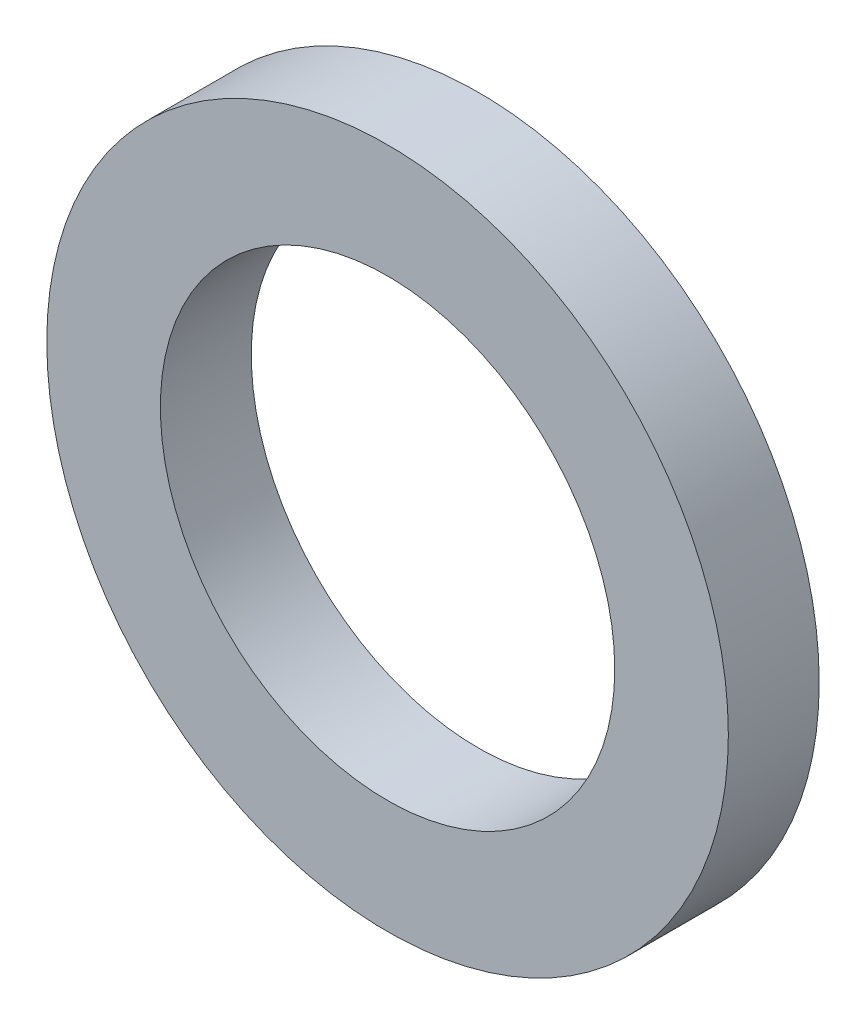
ISO-10303-21;
HEADER;
FILE_DESCRIPTION(('STEP AP214'),'2;1');
FILE_NAME('part.step','',(''),(''),'','','');
FILE_SCHEMA(('AUTOMOTIVE_DESIGN { 1 0 10303 214 1 1 1 1 }'));
ENDSEC;
DATA;
#1=APPLICATION_CONTEXT('core data for automotive mechanical design processes');
#2=APPLICATION_PROTOCOL_DEFINITION('international standard','automotive_design',2000,#1);
#3=PRODUCT_CONTEXT('',#1,'mechanical');
#4=PRODUCT('Part','Part','',(#3));
#5=PRODUCT_RELATED_PRODUCT_CATEGORY('part','',(#4));
#6=PRODUCT_DEFINITION_FORMATION('','',#4);
#7=PRODUCT_DEFINITION_CONTEXT('part definition',#1,'design');
#8=PRODUCT_DEFINITION('design','',#6,#7);
#9=PRODUCT_DEFINITION_SHAPE('','',#8);
#10=(LENGTH_UNIT() NAMED_UNIT(*) SI_UNIT(.MILLI.,.METRE.));
#11=(NAMED_UNIT(*) PLANE_ANGLE_UNIT() SI_UNIT($,.RADIAN.));
#12=(NAMED_UNIT(*) SI_UNIT($,.STERADIAN.) SOLID_ANGLE_UNIT());
#13=UNCERTAINTY_MEASURE_WITH_UNIT(LENGTH_MEASURE(1.E-05),#10,'distance_accuracy_value','');
#14=(GEOMETRIC_REPRESENTATION_CONTEXT(3) GLOBAL_UNCERTAINTY_ASSIGNED_CONTEXT((#13)) GLOBAL_UNIT_ASSIGNED_CONTEXT((#10,
#11,#12)) REPRESENTATION_CONTEXT('',''));
#15=CARTESIAN_POINT('',(0.,0.,0.));
#16=DIRECTION('',(0.,0.,1.));
#17=DIRECTION('',(1.,0.,0.));
#18=AXIS2_PLACEMENT_3D('',#15,#16,#17);
#19=CARTESIAN_POINT('',(0.,0.,0.8));
#20=DIRECTION('',(0.,0.,1.));
#21=DIRECTION('',(1.,0.,0.));
#22=AXIS2_PLACEMENT_3D('',#19,#20,#21);
#23=PLANE('',#22);
#24=CARTESIAN_POINT('',(0.,0.,0.8));
#25=DIRECTION('',(0.,0.,1.));
#26=DIRECTION('',(1.,0.,0.));
#27=AXIS2_PLACEMENT_3D('',#24,#25,#26);
#28=CIRCLE('',#27,3.);
#29=CARTESIAN_POINT('',(3.,0.,0.8));
#30=VERTEX_POINT('',#29);
#31=EDGE_CURVE('E10',#30,#30,#28,.T.);
#32=ORIENTED_EDGE('',*,*,#31,.T.);
#33=EDGE_LOOP('',(#32));
#34=FACE_BOUND('',#33,.T.);
#35=CARTESIAN_POINT('',(0.,0.,0.8));
#36=DIRECTION('',(0.,0.,1.));
#37=DIRECTION('',(1.,0.,0.));
#38=AXIS2_PLACEMENT_3D('',#35,#36,#37);
#39=CIRCLE('',#38,2.);
#40=CARTESIAN_POINT('',(2.,0.,0.8));
#41=VERTEX_POINT('',#40);
#42=EDGE_CURVE('E54',#41,#41,#39,.T.);
#43=ORIENTED_EDGE('',*,*,#42,.F.);
#44=EDGE_LOOP('',(#43));
#45=FACE_BOUND('',#44,.T.);
#46=ADVANCED_FACE('F41',(#34,#45),#23,.T.);
#47=CARTESIAN_POINT('',(0.,0.,0.));
#48=DIRECTION('',(0.,0.,1.));
#49=DIRECTION('',(1.,0.,0.));
#50=AXIS2_PLACEMENT_3D('',#47,#48,#49);
#51=PLANE('',#50);
#52=CARTESIAN_POINT('',(0.,0.,0.));
#53=DIRECTION('',(0.,0.,1.));
#54=DIRECTION('',(1.,0.,0.));
#55=AXIS2_PLACEMENT_3D('',#52,#53,#54);
#56=CIRCLE('',#55,3.);
#57=CARTESIAN_POINT('',(3.,0.,0.));
#58=VERTEX_POINT('',#57);
#59=EDGE_CURVE('E45',#58,#58,#56,.T.);
#60=ORIENTED_EDGE('',*,*,#59,.F.);
#61=EDGE_LOOP('',(#60));
#62=FACE_BOUND('',#61,.T.);
#63=CARTESIAN_POINT('',(0.,0.,0.));
#64=DIRECTION('',(0.,0.,1.));
#65=DIRECTION('',(1.,0.,0.));
#66=AXIS2_PLACEMENT_3D('',#63,#64,#65);
#67=CIRCLE('',#66,2.);
#68=CARTESIAN_POINT('',(2.,0.,0.));
#69=VERTEX_POINT('',#68);
#70=EDGE_CURVE('E56',#69,#69,#67,.T.);
#71=ORIENTED_EDGE('',*,*,#70,.T.);
#72=EDGE_LOOP('',(#71));
#73=FACE_BOUND('',#72,.T.);
#74=ADVANCED_FACE('F68',(#62,#73),#51,.F.);
#75=CARTESIAN_POINT('',(0.,0.,0.8));
#76=DIRECTION('',(0.,0.,-1.));
#77=DIRECTION('',(-1.,0.,0.));
#78=AXIS2_PLACEMENT_3D('',#75,#76,#77);
#79=CYLINDRICAL_SURFACE('',#78,3.);
#80=ORIENTED_EDGE('',*,*,#31,.F.);
#81=EDGE_LOOP('',(#80));
#82=FACE_BOUND('',#81,.T.);
#83=ORIENTED_EDGE('',*,*,#59,.T.);
#84=EDGE_LOOP('',(#83));
#85=FACE_BOUND('',#84,.T.);
#86=ADVANCED_FACE('F43',(#82,#85),#79,.T.);
#87=CARTESIAN_POINT('',(0.,0.,0.8));
#88=DIRECTION('',(0.,0.,-1.));
#89=DIRECTION('',(-1.,0.,0.));
#90=AXIS2_PLACEMENT_3D('',#87,#88,#89);
#91=CYLINDRICAL_SURFACE('',#90,2.);
#92=ORIENTED_EDGE('',*,*,#42,.T.);
#93=EDGE_LOOP('',(#92));
#94=FACE_BOUND('',#93,.T.);
#95=ORIENTED_EDGE('',*,*,#70,.F.);
#96=EDGE_LOOP('',(#95));
#97=FACE_BOUND('',#96,.T.);
#98=ADVANCED_FACE('F64',(#94,#97),#91,.F.);
#99=CLOSED_SHELL('',(#46,#74,#86,#98));
#100=MANIFOLD_SOLID_BREP('B2',#99);
#101=ADVANCED_BREP_SHAPE_REPRESENTATION('',(#18,#100),#14);
#102=SHAPE_DEFINITION_REPRESENTATION(#9,#101);
ENDSEC;
END-ISO-10303-21;
